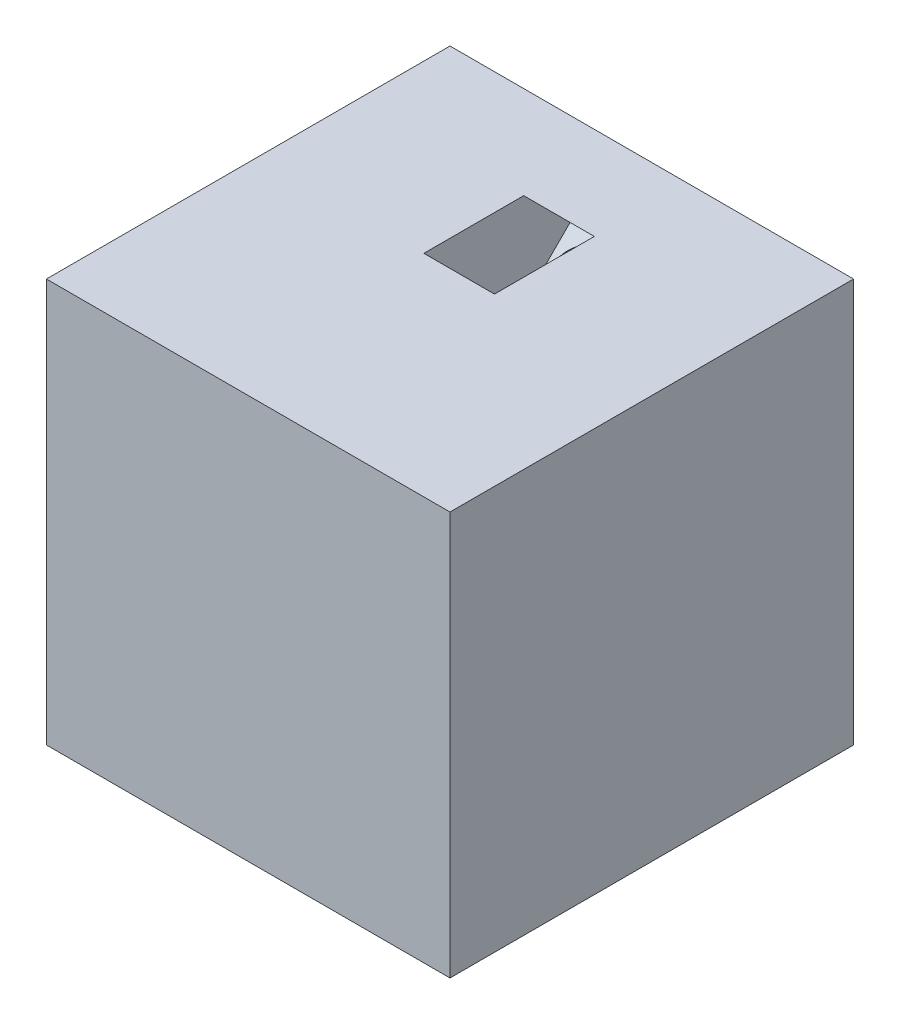
ISO-10303-21;
HEADER;
FILE_DESCRIPTION(('STEP AP214'),'2;1');
FILE_NAME('part.step','',(''),(''),'','','');
FILE_SCHEMA(('AUTOMOTIVE_DESIGN { 1 0 10303 214 1 1 1 1 }'));
ENDSEC;
DATA;
#1=APPLICATION_CONTEXT('core data for automotive mechanical design processes');
#2=APPLICATION_PROTOCOL_DEFINITION('international standard','automotive_design',2000,#1);
#3=PRODUCT_CONTEXT('',#1,'mechanical');
#4=PRODUCT('Part','Part','',(#3));
#5=PRODUCT_RELATED_PRODUCT_CATEGORY('part','',(#4));
#6=PRODUCT_DEFINITION_FORMATION('','',#4);
#7=PRODUCT_DEFINITION_CONTEXT('part definition',#1,'design');
#8=PRODUCT_DEFINITION('design','',#6,#7);
#9=PRODUCT_DEFINITION_SHAPE('','',#8);
#10=(LENGTH_UNIT() NAMED_UNIT(*) SI_UNIT(.MILLI.,.METRE.));
#11=(NAMED_UNIT(*) PLANE_ANGLE_UNIT() SI_UNIT($,.RADIAN.));
#12=(NAMED_UNIT(*) SI_UNIT($,.STERADIAN.) SOLID_ANGLE_UNIT());
#13=UNCERTAINTY_MEASURE_WITH_UNIT(LENGTH_MEASURE(1.E-05),#10,'distance_accuracy_value','');
#14=(GEOMETRIC_REPRESENTATION_CONTEXT(3) GLOBAL_UNCERTAINTY_ASSIGNED_CONTEXT((#13)) GLOBAL_UNIT_ASSIGNED_CONTEXT((#10,
#11,#12)) REPRESENTATION_CONTEXT('',''));
#15=CARTESIAN_POINT('',(0.,0.,0.));
#16=DIRECTION('',(0.,0.,1.));
#17=DIRECTION('',(1.,0.,0.));
#18=AXIS2_PLACEMENT_3D('',#15,#16,#17);
#19=CARTESIAN_POINT('',(-121.164127837515,35.6451612903226,40.));
#20=DIRECTION('',(0.,-1.,0.));
#21=DIRECTION('',(0.,0.,-1.));
#22=AXIS2_PLACEMENT_3D('',#19,#20,#21);
#23=PLANE('',#22);
#24=DIRECTION('',(-1.,0.,0.));
#25=VECTOR('',#24,1.);
#26=CARTESIAN_POINT('',(-121.164127837515,35.6451612903226,0.));
#27=LINE('',#26,#25);
#28=CARTESIAN_POINT('',(-81.164127837515,35.6451612903226,0.));
#29=VERTEX_POINT('',#28);
#30=CARTESIAN_POINT('',(-121.164127837515,35.6451612903226,0.));
#31=VERTEX_POINT('',#30);
#32=EDGE_CURVE('E201',#29,#31,#27,.T.);
#33=ORIENTED_EDGE('',*,*,#32,.T.);
#34=DIRECTION('',(0.,0.,-1.));
#35=VECTOR('',#34,1.);
#36=CARTESIAN_POINT('',(-121.164127837515,35.6451612903226,40.));
#37=LINE('',#36,#35);
#38=CARTESIAN_POINT('',(-121.164127837515,35.6451612903226,40.));
#39=VERTEX_POINT('',#38);
#40=EDGE_CURVE('E210',#39,#31,#37,.T.);
#41=ORIENTED_EDGE('',*,*,#40,.F.);
#42=DIRECTION('',(-1.,0.,0.));
#43=VECTOR('',#42,1.);
#44=CARTESIAN_POINT('',(-121.164127837515,35.6451612903226,40.));
#45=LINE('',#44,#43);
#46=CARTESIAN_POINT('',(-81.164127837515,35.6451612903226,40.));
#47=VERTEX_POINT('',#46);
#48=EDGE_CURVE('E207',#47,#39,#45,.T.);
#49=ORIENTED_EDGE('',*,*,#48,.F.);
#50=DIRECTION('',(0.,0.,-1.));
#51=VECTOR('',#50,1.);
#52=CARTESIAN_POINT('',(-81.164127837515,35.6451612903226,40.));
#53=LINE('',#52,#51);
#54=EDGE_CURVE('E227',#47,#29,#53,.T.);
#55=ORIENTED_EDGE('',*,*,#54,.T.);
#56=EDGE_LOOP('',(#33,#41,#49,#55));
#57=FACE_BOUND('',#56,.T.);
#58=DIRECTION('',(0.,0.,-1.));
#59=VECTOR('',#58,1.);
#60=CARTESIAN_POINT('',(-97.664127837515,35.6451612903226,40.));
#61=LINE('',#60,#59);
#62=CARTESIAN_POINT('',(-97.664127837515,35.6451612903226,19.0918830920368));
#63=VERTEX_POINT('',#62);
#64=CARTESIAN_POINT('',(-97.664127837515,35.6451612903226,9.19238815542511));
#65=VERTEX_POINT('',#64);
#66=EDGE_CURVE('E254',#63,#65,#61,.T.);
#67=ORIENTED_EDGE('',*,*,#66,.F.);
#68=DIRECTION('',(1.,0.,0.));
#69=VECTOR('',#68,1.);
#70=CARTESIAN_POINT('',(-121.164127837515,35.6451612903226,19.0918830920368));
#71=LINE('',#70,#69);
#72=CARTESIAN_POINT('',(-104.664127837515,35.6451612903226,19.0918830920368));
#73=VERTEX_POINT('',#72);
#74=EDGE_CURVE('E239',#73,#63,#71,.T.);
#75=ORIENTED_EDGE('',*,*,#74,.F.);
#76=DIRECTION('',(0.,0.,1.));
#77=VECTOR('',#76,1.);
#78=CARTESIAN_POINT('',(-104.664127837515,35.6451612903226,40.));
#79=LINE('',#78,#77);
#80=CARTESIAN_POINT('',(-104.664127837515,35.6451612903226,9.19238815542511));
#81=VERTEX_POINT('',#80);
#82=EDGE_CURVE('E248',#81,#73,#79,.T.);
#83=ORIENTED_EDGE('',*,*,#82,.F.);
#84=DIRECTION('',(-1.,0.,0.));
#85=VECTOR('',#84,1.);
#86=CARTESIAN_POINT('',(-121.164127837515,35.6451612903226,9.19238815542511));
#87=LINE('',#86,#85);
#88=EDGE_CURVE('E251',#65,#81,#87,.T.);
#89=ORIENTED_EDGE('',*,*,#88,.F.);
#90=EDGE_LOOP('',(#67,#75,#83,#89));
#91=FACE_BOUND('',#90,.T.);
#92=ADVANCED_FACE('F38',(#57,#91),#23,.F.);
#93=CARTESIAN_POINT('',(-101.164127837515,8.57409347845713,-12.9289321881345));
#94=DIRECTION('',(0.,0.707106781186547,0.707106781186548));
#95=DIRECTION('',(0.,-0.707106781186548,0.707106781186547));
#96=AXIS2_PLACEMENT_3D('',#93,#94,#95);
#97=CYLINDRICAL_SURFACE('',#96,3.00000000000001);
#98=CARTESIAN_POINT('',(-101.164127837515,21.5030256665917,0.));
#99=DIRECTION('',(0.,0.,1.));
#100=DIRECTION('',(0.,1.,0.));
#101=AXIS2_PLACEMENT_3D('',#98,#99,#100);
#102=ELLIPSE('',#101,4.2426406871193,3.00000000000001);
#103=CARTESIAN_POINT('',(-101.164127837515,25.7456663537109,0.));
#104=VERTEX_POINT('',#103);
#105=EDGE_CURVE('E216',#104,#104,#102,.T.);
#106=ORIENTED_EDGE('',*,*,#105,.F.);
#107=EDGE_LOOP('',(#106));
#108=FACE_BOUND('',#107,.T.);
#109=CARTESIAN_POINT('',(-101.164127837515,28.5740934784571,7.07106781186548));
#110=DIRECTION('',(0.,0.707106781186547,0.707106781186548));
#111=DIRECTION('',(0.,-0.707106781186548,0.707106781186547));
#112=AXIS2_PLACEMENT_3D('',#109,#110,#111);
#113=CIRCLE('',#112,3.00000000000001);
#114=CARTESIAN_POINT('',(-101.164127837515,26.4527731348975,9.19238815542513));
#115=VERTEX_POINT('',#114);
#116=EDGE_CURVE('E195',#115,#115,#113,.F.);
#117=ORIENTED_EDGE('',*,*,#116,.F.);
#118=EDGE_LOOP('',(#117));
#119=FACE_BOUND('',#118,.T.);
#120=ADVANCED_FACE('F286',(#108,#119),#97,.F.);
#121=CARTESIAN_POINT('',(-121.164127837515,35.6451612903226,40.));
#122=DIRECTION('',(1.,0.,0.));
#123=DIRECTION('',(0.,0.,-1.));
#124=AXIS2_PLACEMENT_3D('',#121,#122,#123);
#125=PLANE('',#124);
#126=DIRECTION('',(0.,0.,1.));
#127=VECTOR('',#126,1.);
#128=CARTESIAN_POINT('',(-121.164127837515,9.14516129032259,40.));
#129=LINE('',#128,#127);
#130=CARTESIAN_POINT('',(-121.164127837515,9.14516129032259,9.19238815542511));
#131=VERTEX_POINT('',#130);
#132=CARTESIAN_POINT('',(-121.164127837515,9.14516129032259,19.0918830920368));
#133=VERTEX_POINT('',#132);
#134=EDGE_CURVE('E47',#131,#133,#129,.T.);
#135=ORIENTED_EDGE('',*,*,#134,.T.);
#136=DIRECTION('',(0.,-1.,0.));
#137=VECTOR('',#136,1.);
#138=CARTESIAN_POINT('',(-121.164127837515,35.6451612903226,19.0918830920368));
#139=LINE('',#138,#137);
#140=CARTESIAN_POINT('',(-121.164127837515,2.14516129032259,19.0918830920368));
#141=VERTEX_POINT('',#140);
#142=EDGE_CURVE('E11',#133,#141,#139,.T.);
#143=ORIENTED_EDGE('',*,*,#142,.T.);
#144=DIRECTION('',(0.,0.,-1.));
#145=VECTOR('',#144,1.);
#146=CARTESIAN_POINT('',(-121.164127837515,2.14516129032259,40.));
#147=LINE('',#146,#145);
#148=CARTESIAN_POINT('',(-121.164127837515,2.14516129032259,9.19238815542511));
#149=VERTEX_POINT('',#148);
#150=EDGE_CURVE('E131',#141,#149,#147,.T.);
#151=ORIENTED_EDGE('',*,*,#150,.T.);
#152=DIRECTION('',(0.,1.,0.));
#153=VECTOR('',#152,1.);
#154=CARTESIAN_POINT('',(-121.164127837515,35.6451612903226,9.1923881554251));
#155=LINE('',#154,#153);
#156=EDGE_CURVE('E265',#149,#131,#155,.T.);
#157=ORIENTED_EDGE('',*,*,#156,.T.);
#158=EDGE_LOOP('',(#135,#143,#151,#157));
#159=FACE_BOUND('',#158,.T.);
#160=DIRECTION('',(0.,-1.,0.));
#161=VECTOR('',#160,1.);
#162=CARTESIAN_POINT('',(-121.164127837515,35.6451612903226,0.));
#163=LINE('',#162,#161);
#164=CARTESIAN_POINT('',(-121.164127837515,-4.35483870967741,0.));
#165=VERTEX_POINT('',#164);
#166=EDGE_CURVE('E211',#31,#165,#163,.T.);
#167=ORIENTED_EDGE('',*,*,#166,.T.);
#168=DIRECTION('',(0.,0.,-1.));
#169=VECTOR('',#168,1.);
#170=CARTESIAN_POINT('',(-121.164127837515,-4.35483870967741,40.));
#171=LINE('',#170,#169);
#172=CARTESIAN_POINT('',(-121.164127837515,-4.35483870967741,40.));
#173=VERTEX_POINT('',#172);
#174=EDGE_CURVE('E235',#173,#165,#171,.T.);
#175=ORIENTED_EDGE('',*,*,#174,.F.);
#176=DIRECTION('',(0.,-1.,0.));
#177=VECTOR('',#176,1.);
#178=CARTESIAN_POINT('',(-121.164127837515,35.6451612903226,40.));
#179=LINE('',#178,#177);
#180=EDGE_CURVE('E196',#39,#173,#179,.T.);
#181=ORIENTED_EDGE('',*,*,#180,.F.);
#182=ORIENTED_EDGE('',*,*,#40,.T.);
#183=EDGE_LOOP('',(#167,#175,#181,#182));
#184=FACE_BOUND('',#183,.T.);
#185=ADVANCED_FACE('F40',(#159,#184),#125,.F.);
#186=CARTESIAN_POINT('',(-121.164127837515,-4.35483870967741,40.));
#187=DIRECTION('',(0.,1.,0.));
#188=DIRECTION('',(0.,0.,1.));
#189=AXIS2_PLACEMENT_3D('',#186,#187,#188);
#190=PLANE('',#189);
#191=DIRECTION('',(1.,0.,0.));
#192=VECTOR('',#191,1.);
#193=CARTESIAN_POINT('',(-121.164127837515,-4.35483870967741,0.));
#194=LINE('',#193,#192);
#195=CARTESIAN_POINT('',(-81.164127837515,-4.35483870967741,0.));
#196=VERTEX_POINT('',#195);
#197=EDGE_CURVE('E215',#165,#196,#194,.T.);
#198=ORIENTED_EDGE('',*,*,#197,.T.);
#199=DIRECTION('',(0.,0.,-1.));
#200=VECTOR('',#199,1.);
#201=CARTESIAN_POINT('',(-81.164127837515,-4.35483870967741,40.));
#202=LINE('',#201,#200);
#203=CARTESIAN_POINT('',(-81.164127837515,-4.35483870967741,40.));
#204=VERTEX_POINT('',#203);
#205=EDGE_CURVE('E231',#204,#196,#202,.T.);
#206=ORIENTED_EDGE('',*,*,#205,.F.);
#207=DIRECTION('',(1.,0.,0.));
#208=VECTOR('',#207,1.);
#209=CARTESIAN_POINT('',(-121.164127837515,-4.35483870967741,40.));
#210=LINE('',#209,#208);
#211=EDGE_CURVE('E200',#173,#204,#210,.T.);
#212=ORIENTED_EDGE('',*,*,#211,.F.);
#213=ORIENTED_EDGE('',*,*,#174,.T.);
#214=EDGE_LOOP('',(#198,#206,#212,#213));
#215=FACE_BOUND('',#214,.T.);
#216=ADVANCED_FACE('F302',(#215),#190,.F.);
#217=CARTESIAN_POINT('',(-81.164127837515,35.6451612903226,40.));
#218=DIRECTION('',(-1.,0.,0.));
#219=DIRECTION('',(0.,0.,1.));
#220=AXIS2_PLACEMENT_3D('',#217,#218,#219);
#221=PLANE('',#220);
#222=DIRECTION('',(0.,1.,0.));
#223=VECTOR('',#222,1.);
#224=CARTESIAN_POINT('',(-81.164127837515,35.6451612903226,0.));
#225=LINE('',#224,#223);
#226=EDGE_CURVE('E219',#196,#29,#225,.T.);
#227=ORIENTED_EDGE('',*,*,#226,.T.);
#228=ORIENTED_EDGE('',*,*,#54,.F.);
#229=DIRECTION('',(0.,1.,0.));
#230=VECTOR('',#229,1.);
#231=CARTESIAN_POINT('',(-81.164127837515,35.6451612903226,40.));
#232=LINE('',#231,#230);
#233=EDGE_CURVE('E204',#204,#47,#232,.T.);
#234=ORIENTED_EDGE('',*,*,#233,.F.);
#235=ORIENTED_EDGE('',*,*,#205,.T.);
#236=EDGE_LOOP('',(#227,#228,#234,#235));
#237=FACE_BOUND('',#236,.T.);
#238=ADVANCED_FACE('F299',(#237),#221,.F.);
#239=CARTESIAN_POINT('',(0.,0.,40.));
#240=DIRECTION('',(0.,0.,1.));
#241=DIRECTION('',(1.,0.,0.));
#242=AXIS2_PLACEMENT_3D('',#239,#240,#241);
#243=PLANE('',#242);
#244=ORIENTED_EDGE('',*,*,#180,.T.);
#245=ORIENTED_EDGE('',*,*,#211,.T.);
#246=ORIENTED_EDGE('',*,*,#233,.T.);
#247=ORIENTED_EDGE('',*,*,#48,.T.);
#248=EDGE_LOOP('',(#244,#245,#246,#247));
#249=FACE_BOUND('',#248,.T.);
#250=ADVANCED_FACE('F301',(#249),#243,.T.);
#251=CARTESIAN_POINT('',(0.,0.,0.));
#252=DIRECTION('',(0.,0.,1.));
#253=DIRECTION('',(1.,0.,0.));
#254=AXIS2_PLACEMENT_3D('',#251,#252,#253);
#255=PLANE('',#254);
#256=CARTESIAN_POINT('',(-107.021992213784,5.6451612903226,0.));
#257=DIRECTION('',(0.,0.,1.));
#258=DIRECTION('',(1.,0.,0.));
#259=AXIS2_PLACEMENT_3D('',#256,#257,#258);
#260=ELLIPSE('',#259,4.24264068711928,3.);
#261=CARTESIAN_POINT('',(-102.779351526665,5.6451612903226,0.));
#262=VERTEX_POINT('',#261);
#263=EDGE_CURVE('E172',#262,#262,#260,.T.);
#264=ORIENTED_EDGE('',*,*,#263,.T.);
#265=EDGE_LOOP('',(#264));
#266=FACE_BOUND('',#265,.T.);
#267=ORIENTED_EDGE('',*,*,#105,.T.);
#268=EDGE_LOOP('',(#267));
#269=FACE_BOUND('',#268,.T.);
#270=ORIENTED_EDGE('',*,*,#166,.F.);
#271=ORIENTED_EDGE('',*,*,#32,.F.);
#272=ORIENTED_EDGE('',*,*,#226,.F.);
#273=ORIENTED_EDGE('',*,*,#197,.F.);
#274=EDGE_LOOP('',(#270,#271,#272,#273));
#275=FACE_BOUND('',#274,.T.);
#276=ADVANCED_FACE('F297',(#266,#269,#275),#255,.F.);
#277=CARTESIAN_POINT('',(-97.664127837515,42.7162291021881,26.1629509039023));
#278=DIRECTION('',(-1.,0.,0.));
#279=DIRECTION('',(0.,0.,1.));
#280=AXIS2_PLACEMENT_3D('',#277,#278,#279);
#281=PLANE('',#280);
#282=ORIENTED_EDGE('',*,*,#66,.T.);
#283=DIRECTION('',(0.,-0.707106781186547,-0.707106781186548));
#284=VECTOR('',#283,1.);
#285=CARTESIAN_POINT('',(-97.664127837515,47.6659765704939,21.2132034355964));
#286=LINE('',#285,#284);
#287=CARTESIAN_POINT('',(-97.664127837515,31.04896721261,4.59619407771256));
#288=VERTEX_POINT('',#287);
#289=EDGE_CURVE('E192',#65,#288,#286,.T.);
#290=ORIENTED_EDGE('',*,*,#289,.T.);
#291=DIRECTION('',(0.,0.707106781186548,-0.707106781186547));
#292=VECTOR('',#291,1.);
#293=CARTESIAN_POINT('',(-97.664127837515,26.0992197443042,9.54594154601839));
#294=LINE('',#293,#292);
#295=CARTESIAN_POINT('',(-97.664127837515,26.0992197443042,9.54594154601839));
#296=VERTEX_POINT('',#295);
#297=EDGE_CURVE('E167',#296,#288,#294,.T.);
#298=ORIENTED_EDGE('',*,*,#297,.F.);
#299=DIRECTION('',(0.,-0.707106781186547,-0.707106781186548));
#300=VECTOR('',#299,1.);
#301=CARTESIAN_POINT('',(-97.664127837515,42.7162291021881,26.1629509039023));
#302=LINE('',#301,#300);
#303=EDGE_CURVE('E184',#63,#296,#302,.T.);
#304=ORIENTED_EDGE('',*,*,#303,.F.);
#305=EDGE_LOOP('',(#282,#290,#298,#304));
#306=FACE_BOUND('',#305,.T.);
#307=ADVANCED_FACE('F325',(#306),#281,.T.);
#308=CARTESIAN_POINT('',(-97.664127837515,47.6659765704939,21.2132034355964));
#309=DIRECTION('',(0.,-0.707106781186548,0.707106781186547));
#310=DIRECTION('',(0.,-0.707106781186547,-0.707106781186548));
#311=AXIS2_PLACEMENT_3D('',#308,#309,#310);
#312=PLANE('',#311);
#313=ORIENTED_EDGE('',*,*,#88,.T.);
#314=DIRECTION('',(0.,-0.707106781186547,-0.707106781186548));
#315=VECTOR('',#314,1.);
#316=CARTESIAN_POINT('',(-104.664127837515,47.6659765704939,21.2132034355964));
#317=LINE('',#316,#315);
#318=CARTESIAN_POINT('',(-104.664127837515,31.04896721261,4.59619407771256));
#319=VERTEX_POINT('',#318);
#320=EDGE_CURVE('E189',#81,#319,#317,.T.);
#321=ORIENTED_EDGE('',*,*,#320,.T.);
#322=DIRECTION('',(-1.,0.,0.));
#323=VECTOR('',#322,1.);
#324=CARTESIAN_POINT('',(-97.664127837515,31.04896721261,4.59619407771256));
#325=LINE('',#324,#323);
#326=EDGE_CURVE('E171',#288,#319,#325,.T.);
#327=ORIENTED_EDGE('',*,*,#326,.F.);
#328=ORIENTED_EDGE('',*,*,#289,.F.);
#329=EDGE_LOOP('',(#313,#321,#327,#328));
#330=FACE_BOUND('',#329,.T.);
#331=ADVANCED_FACE('F330',(#330),#312,.T.);
#332=CARTESIAN_POINT('',(-104.664127837515,42.7162291021881,26.1629509039023));
#333=DIRECTION('',(1.,0.,0.));
#334=DIRECTION('',(0.,0.,-1.));
#335=AXIS2_PLACEMENT_3D('',#332,#333,#334);
#336=PLANE('',#335);
#337=ORIENTED_EDGE('',*,*,#82,.T.);
#338=DIRECTION('',(0.,-0.707106781186547,-0.707106781186548));
#339=VECTOR('',#338,1.);
#340=CARTESIAN_POINT('',(-104.664127837515,42.7162291021881,26.1629509039023));
#341=LINE('',#340,#339);
#342=CARTESIAN_POINT('',(-104.664127837515,26.0992197443042,9.54594154601839));
#343=VERTEX_POINT('',#342);
#344=EDGE_CURVE('E62',#73,#343,#341,.T.);
#345=ORIENTED_EDGE('',*,*,#344,.T.);
#346=DIRECTION('',(0.,-0.707106781186548,0.707106781186547));
#347=VECTOR('',#346,1.);
#348=CARTESIAN_POINT('',(-104.664127837515,26.0992197443042,9.54594154601839));
#349=LINE('',#348,#347);
#350=EDGE_CURVE('E176',#319,#343,#349,.T.);
#351=ORIENTED_EDGE('',*,*,#350,.F.);
#352=ORIENTED_EDGE('',*,*,#320,.F.);
#353=EDGE_LOOP('',(#337,#345,#351,#352));
#354=FACE_BOUND('',#353,.T.);
#355=ADVANCED_FACE('F334',(#354),#336,.T.);
#356=CARTESIAN_POINT('',(-97.664127837515,42.7162291021881,26.1629509039023));
#357=DIRECTION('',(0.,0.707106781186548,-0.707106781186547));
#358=DIRECTION('',(0.,0.707106781186547,0.707106781186548));
#359=AXIS2_PLACEMENT_3D('',#356,#357,#358);
#360=PLANE('',#359);
#361=ORIENTED_EDGE('',*,*,#74,.T.);
#362=ORIENTED_EDGE('',*,*,#303,.T.);
#363=DIRECTION('',(1.,0.,0.));
#364=VECTOR('',#363,1.);
#365=CARTESIAN_POINT('',(-97.664127837515,26.0992197443042,9.54594154601839));
#366=LINE('',#365,#364);
#367=EDGE_CURVE('E180',#343,#296,#366,.T.);
#368=ORIENTED_EDGE('',*,*,#367,.F.);
#369=ORIENTED_EDGE('',*,*,#344,.F.);
#370=EDGE_LOOP('',(#361,#362,#368,#369));
#371=FACE_BOUND('',#370,.T.);
#372=ADVANCED_FACE('F338',(#371),#360,.T.);
#373=CARTESIAN_POINT('',(0.,17.8225806451613,17.8225806451613));
#374=DIRECTION('',(0.,0.707106781186547,0.707106781186548));
#375=DIRECTION('',(0.,-0.707106781186548,0.707106781186547));
#376=AXIS2_PLACEMENT_3D('',#373,#374,#375);
#377=PLANE('',#376);
#378=ORIENTED_EDGE('',*,*,#297,.T.);
#379=ORIENTED_EDGE('',*,*,#326,.T.);
#380=ORIENTED_EDGE('',*,*,#350,.T.);
#381=ORIENTED_EDGE('',*,*,#367,.T.);
#382=EDGE_LOOP('',(#378,#379,#380,#381));
#383=FACE_BOUND('',#382,.T.);
#384=ORIENTED_EDGE('',*,*,#116,.T.);
#385=EDGE_LOOP('',(#384));
#386=FACE_BOUND('',#385,.T.);
#387=ADVANCED_FACE('F342',(#383,#386),#377,.T.);
#388=CARTESIAN_POINT('',(-134.09306002565,5.6451612903226,27.0710678118655));
#389=DIRECTION('',(0.707106781186547,0.,-0.707106781186548));
#390=DIRECTION('',(-0.707106781186548,0.,-0.707106781186547));
#391=AXIS2_PLACEMENT_3D('',#388,#389,#390);
#392=CYLINDRICAL_SURFACE('',#391,3.);
#393=CARTESIAN_POINT('',(-114.09306002565,5.6451612903226,7.07106781186548));
#394=DIRECTION('',(0.707106781186547,0.,-0.707106781186548));
#395=DIRECTION('',(-0.707106781186548,0.,-0.707106781186547));
#396=AXIS2_PLACEMENT_3D('',#393,#394,#395);
#397=CIRCLE('',#396,3.);
#398=CARTESIAN_POINT('',(-116.214380369209,5.6451612903226,4.94974746830584));
#399=VERTEX_POINT('',#398);
#400=EDGE_CURVE('E161',#399,#399,#397,.F.);
#401=ORIENTED_EDGE('',*,*,#400,.T.);
#402=EDGE_LOOP('',(#401));
#403=FACE_BOUND('',#402,.T.);
#404=ORIENTED_EDGE('',*,*,#263,.F.);
#405=EDGE_LOOP('',(#404));
#406=FACE_BOUND('',#405,.T.);
#407=ADVANCED_FACE('F345',(#403,#406),#392,.F.);
#408=CARTESIAN_POINT('',(-128.235195649381,9.14516129032259,26.1629509039023));
#409=DIRECTION('',(0.707106781186548,0.,0.707106781186547));
#410=DIRECTION('',(0.707106781186547,0.,-0.707106781186548));
#411=AXIS2_PLACEMENT_3D('',#408,#409,#410);
#412=PLANE('',#411);
#413=DIRECTION('',(0.707106781186547,0.,-0.707106781186548));
#414=VECTOR('',#413,1.);
#415=CARTESIAN_POINT('',(-128.235195649381,9.14516129032259,26.1629509039023));
#416=LINE('',#415,#414);
#417=CARTESIAN_POINT('',(-111.618186291497,9.14516129032259,9.54594154601841));
#418=VERTEX_POINT('',#417);
#419=EDGE_CURVE('E151',#133,#418,#416,.T.);
#420=ORIENTED_EDGE('',*,*,#419,.T.);
#421=DIRECTION('',(0.,-1.,0.));
#422=VECTOR('',#421,1.);
#423=CARTESIAN_POINT('',(-111.618186291497,9.14516129032259,9.54594154601841));
#424=LINE('',#423,#422);
#425=CARTESIAN_POINT('',(-111.618186291497,2.14516129032259,9.54594154601841));
#426=VERTEX_POINT('',#425);
#427=EDGE_CURVE('E143',#418,#426,#424,.T.);
#428=ORIENTED_EDGE('',*,*,#427,.T.);
#429=DIRECTION('',(0.707106781186547,0.,-0.707106781186548));
#430=VECTOR('',#429,1.);
#431=CARTESIAN_POINT('',(-128.235195649381,2.14516129032259,26.1629509039023));
#432=LINE('',#431,#430);
#433=EDGE_CURVE('E126',#141,#426,#432,.T.);
#434=ORIENTED_EDGE('',*,*,#433,.F.);
#435=ORIENTED_EDGE('',*,*,#142,.F.);
#436=EDGE_LOOP('',(#420,#428,#434,#435));
#437=FACE_BOUND('',#436,.T.);
#438=ADVANCED_FACE('F149',(#437),#412,.F.);
#439=CARTESIAN_POINT('',(-128.235195649381,9.14516129032259,26.1629509039023));
#440=DIRECTION('',(0.,1.,0.));
#441=DIRECTION('',(0.,0.,1.));
#442=AXIS2_PLACEMENT_3D('',#439,#440,#441);
#443=PLANE('',#442);
#444=DIRECTION('',(0.707106781186547,0.,-0.707106781186548));
#445=VECTOR('',#444,1.);
#446=CARTESIAN_POINT('',(-133.184943117686,9.14516129032259,21.2132034355964));
#447=LINE('',#446,#445);
#448=CARTESIAN_POINT('',(-116.567933759802,9.14516129032259,4.59619407771257));
#449=VERTEX_POINT('',#448);
#450=EDGE_CURVE('E162',#131,#449,#447,.T.);
#451=ORIENTED_EDGE('',*,*,#450,.T.);
#452=DIRECTION('',(0.707106781186548,0.,0.707106781186547));
#453=VECTOR('',#452,1.);
#454=CARTESIAN_POINT('',(-111.618186291497,9.14516129032259,9.54594154601841));
#455=LINE('',#454,#453);
#456=EDGE_CURVE('E135',#449,#418,#455,.T.);
#457=ORIENTED_EDGE('',*,*,#456,.T.);
#458=ORIENTED_EDGE('',*,*,#419,.F.);
#459=ORIENTED_EDGE('',*,*,#134,.F.);
#460=EDGE_LOOP('',(#451,#457,#458,#459));
#461=FACE_BOUND('',#460,.T.);
#462=ADVANCED_FACE('F274',(#461),#443,.F.);
#463=CARTESIAN_POINT('',(-133.184943117686,9.14516129032259,21.2132034355964));
#464=DIRECTION('',(-0.707106781186548,0.,-0.707106781186547));
#465=DIRECTION('',(-0.707106781186547,0.,0.707106781186548));
#466=AXIS2_PLACEMENT_3D('',#463,#464,#465);
#467=PLANE('',#466);
#468=DIRECTION('',(0.707106781186547,0.,-0.707106781186548));
#469=VECTOR('',#468,1.);
#470=CARTESIAN_POINT('',(-133.184943117686,2.14516129032259,21.2132034355964));
#471=LINE('',#470,#469);
#472=CARTESIAN_POINT('',(-116.567933759802,2.14516129032259,4.59619407771257));
#473=VERTEX_POINT('',#472);
#474=EDGE_CURVE('E54',#149,#473,#471,.T.);
#475=ORIENTED_EDGE('',*,*,#474,.T.);
#476=DIRECTION('',(0.,1.,0.));
#477=VECTOR('',#476,1.);
#478=CARTESIAN_POINT('',(-116.567933759802,9.14516129032259,4.59619407771257));
#479=LINE('',#478,#477);
#480=EDGE_CURVE('E146',#473,#449,#479,.T.);
#481=ORIENTED_EDGE('',*,*,#480,.T.);
#482=ORIENTED_EDGE('',*,*,#450,.F.);
#483=ORIENTED_EDGE('',*,*,#156,.F.);
#484=EDGE_LOOP('',(#475,#481,#482,#483));
#485=FACE_BOUND('',#484,.T.);
#486=ADVANCED_FACE('F276',(#485),#467,.F.);
#487=CARTESIAN_POINT('',(-128.235195649381,2.14516129032259,26.1629509039023));
#488=DIRECTION('',(0.,-1.,0.));
#489=DIRECTION('',(0.,0.,-1.));
#490=AXIS2_PLACEMENT_3D('',#487,#488,#489);
#491=PLANE('',#490);
#492=ORIENTED_EDGE('',*,*,#433,.T.);
#493=DIRECTION('',(-0.707106781186548,0.,-0.707106781186547));
#494=VECTOR('',#493,1.);
#495=CARTESIAN_POINT('',(-111.618186291497,2.14516129032259,9.54594154601841));
#496=LINE('',#495,#494);
#497=EDGE_CURVE('E129',#426,#473,#496,.T.);
#498=ORIENTED_EDGE('',*,*,#497,.T.);
#499=ORIENTED_EDGE('',*,*,#474,.F.);
#500=ORIENTED_EDGE('',*,*,#150,.F.);
#501=EDGE_LOOP('',(#492,#498,#499,#500));
#502=FACE_BOUND('',#501,.T.);
#503=ADVANCED_FACE('F128',(#502),#491,.F.);
#504=CARTESIAN_POINT('',(-60.5820639187574,0.,60.5820639187575));
#505=DIRECTION('',(0.707106781186547,0.,-0.707106781186548));
#506=DIRECTION('',(-0.707106781186548,0.,-0.707106781186547));
#507=AXIS2_PLACEMENT_3D('',#504,#505,#506);
#508=PLANE('',#507);
#509=ORIENTED_EDGE('',*,*,#427,.F.);
#510=ORIENTED_EDGE('',*,*,#456,.F.);
#511=ORIENTED_EDGE('',*,*,#480,.F.);
#512=ORIENTED_EDGE('',*,*,#497,.F.);
#513=EDGE_LOOP('',(#509,#510,#511,#512));
#514=FACE_BOUND('',#513,.T.);
#515=ORIENTED_EDGE('',*,*,#400,.F.);
#516=EDGE_LOOP('',(#515));
#517=FACE_BOUND('',#516,.T.);
#518=ADVANCED_FACE('F140',(#514,#517),#508,.F.);
#519=CLOSED_SHELL('',(#92,#120,#185,#216,#238,#250,#276,#307,#331,#355,#372,#387,#407,#438,#462,
#486,#503,#518));
#520=MANIFOLD_SOLID_BREP('B2',#519);
#521=ADVANCED_BREP_SHAPE_REPRESENTATION('',(#18,#520),#14);
#522=SHAPE_DEFINITION_REPRESENTATION(#9,#521);
ENDSEC;
END-ISO-10303-21;
